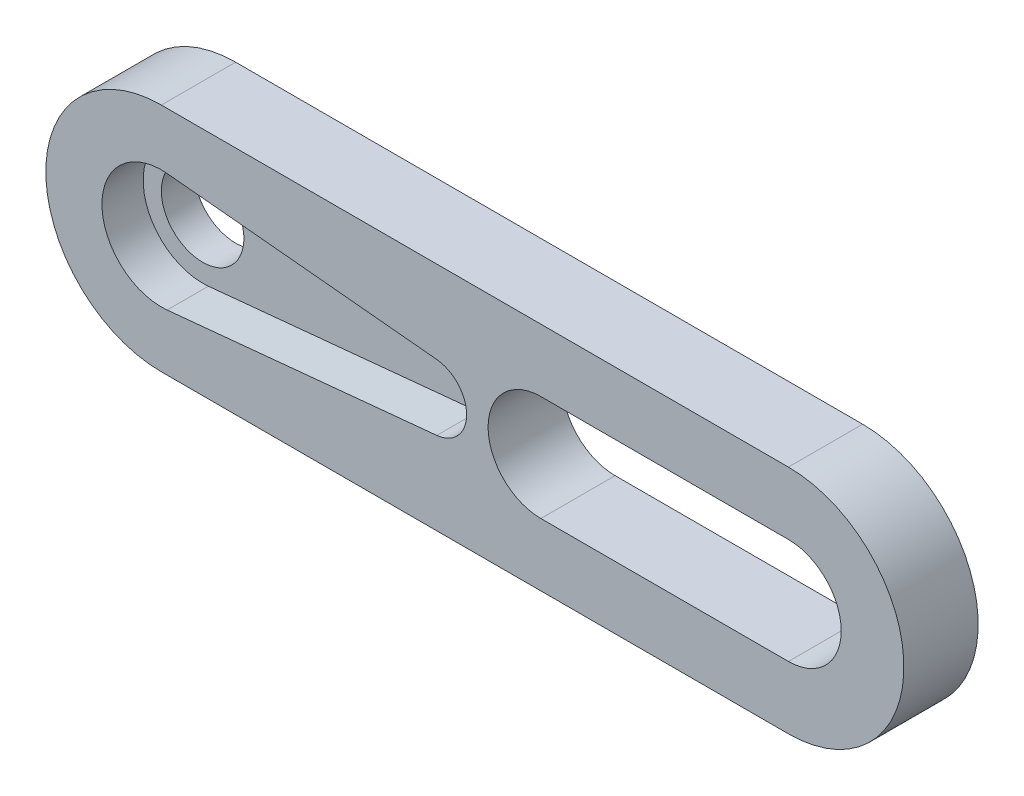
ISO-10303-21;
HEADER;
FILE_DESCRIPTION(('STEP AP214'),'2;1');
FILE_NAME('part.step','',(''),(''),'','','');
FILE_SCHEMA(('AUTOMOTIVE_DESIGN { 1 0 10303 214 1 1 1 1 }'));
ENDSEC;
DATA;
#1=APPLICATION_CONTEXT('core data for automotive mechanical design processes');
#2=APPLICATION_PROTOCOL_DEFINITION('international standard','automotive_design',2000,#1);
#3=PRODUCT_CONTEXT('',#1,'mechanical');
#4=PRODUCT('Part','Part','',(#3));
#5=PRODUCT_RELATED_PRODUCT_CATEGORY('part','',(#4));
#6=PRODUCT_DEFINITION_FORMATION('','',#4);
#7=PRODUCT_DEFINITION_CONTEXT('part definition',#1,'design');
#8=PRODUCT_DEFINITION('design','',#6,#7);
#9=PRODUCT_DEFINITION_SHAPE('','',#8);
#10=(LENGTH_UNIT() NAMED_UNIT(*) SI_UNIT(.MILLI.,.METRE.));
#11=(NAMED_UNIT(*) PLANE_ANGLE_UNIT() SI_UNIT($,.RADIAN.));
#12=(NAMED_UNIT(*) SI_UNIT($,.STERADIAN.) SOLID_ANGLE_UNIT());
#13=UNCERTAINTY_MEASURE_WITH_UNIT(LENGTH_MEASURE(1.E-05),#10,'distance_accuracy_value','');
#14=(GEOMETRIC_REPRESENTATION_CONTEXT(3) GLOBAL_UNCERTAINTY_ASSIGNED_CONTEXT((#13)) GLOBAL_UNIT_ASSIGNED_CONTEXT((#10,
#11,#12)) REPRESENTATION_CONTEXT('',''));
#15=CARTESIAN_POINT('',(0.,0.,0.));
#16=DIRECTION('',(0.,0.,1.));
#17=DIRECTION('',(1.,0.,0.));
#18=AXIS2_PLACEMENT_3D('',#15,#16,#17);
#19=CARTESIAN_POINT('',(0.,0.,2.5));
#20=DIRECTION('',(0.,0.,-1.));
#21=DIRECTION('',(-1.,0.,0.));
#22=AXIS2_PLACEMENT_3D('',#19,#20,#21);
#23=PLANE('',#22);
#24=CARTESIAN_POINT('',(0.,0.,2.5));
#25=DIRECTION('',(0.,0.,1.));
#26=DIRECTION('',(1.,0.,0.));
#27=AXIS2_PLACEMENT_3D('',#24,#25,#26);
#28=CIRCLE('',#27,3.6);
#29=CARTESIAN_POINT('',(0.349090909090909,3.58303440357333,2.5));
#30=VERTEX_POINT('',#29);
#31=CARTESIAN_POINT('',(0.349090909090909,-3.58303440357333,2.5));
#32=VERTEX_POINT('',#31);
#33=EDGE_CURVE('E175',#30,#32,#28,.T.);
#34=ORIENTED_EDGE('',*,*,#33,.F.);
#35=DIRECTION('',(-0.995287334325925,0.096969696969697,0.));
#36=VECTOR('',#35,1.);
#37=CARTESIAN_POINT('',(0.349090909090909,3.58303440357333,2.5));
#38=LINE('',#37,#36);
#39=CARTESIAN_POINT('',(16.6939393939394,1.99057466865185,2.5));
#40=VERTEX_POINT('',#39);
#41=EDGE_CURVE('E183',#40,#30,#38,.T.);
#42=ORIENTED_EDGE('',*,*,#41,.F.);
#43=CARTESIAN_POINT('',(16.5,0.,2.5));
#44=DIRECTION('',(0.,0.,1.));
#45=DIRECTION('',(1.,0.,0.));
#46=AXIS2_PLACEMENT_3D('',#43,#44,#45);
#47=CIRCLE('',#46,2.);
#48=CARTESIAN_POINT('',(16.6939393939394,-1.99057466865185,2.5));
#49=VERTEX_POINT('',#48);
#50=EDGE_CURVE('E180',#49,#40,#47,.T.);
#51=ORIENTED_EDGE('',*,*,#50,.F.);
#52=DIRECTION('',(0.995287334325925,0.0969696969696969,0.));
#53=VECTOR('',#52,1.);
#54=CARTESIAN_POINT('',(16.6939393939394,-1.99057466865185,2.5));
#55=LINE('',#54,#53);
#56=EDGE_CURVE('E177',#32,#49,#55,.T.);
#57=ORIENTED_EDGE('',*,*,#56,.F.);
#58=EDGE_LOOP('',(#34,#42,#51,#57));
#59=FACE_BOUND('',#58,.T.);
#60=CARTESIAN_POINT('',(0.,0.,2.5));
#61=DIRECTION('',(0.,0.,1.));
#62=DIRECTION('',(-1.,0.,0.));
#63=AXIS2_PLACEMENT_3D('',#60,#61,#62);
#64=CIRCLE('',#63,7.);
#65=CARTESIAN_POINT('',(0.,7.,2.5));
#66=VERTEX_POINT('',#65);
#67=CARTESIAN_POINT('',(0.,-7.,2.5));
#68=VERTEX_POINT('',#67);
#69=EDGE_CURVE('E204',#66,#68,#64,.T.);
#70=ORIENTED_EDGE('',*,*,#69,.T.);
#71=DIRECTION('',(1.,0.,0.));
#72=VECTOR('',#71,1.);
#73=CARTESIAN_POINT('',(0.,-7.,2.5));
#74=LINE('',#73,#72);
#75=CARTESIAN_POINT('',(38.,-7.,2.5));
#76=VERTEX_POINT('',#75);
#77=EDGE_CURVE('E207',#68,#76,#74,.T.);
#78=ORIENTED_EDGE('',*,*,#77,.T.);
#79=CARTESIAN_POINT('',(38.,0.,2.5));
#80=DIRECTION('',(0.,0.,1.));
#81=DIRECTION('',(-1.,0.,0.));
#82=AXIS2_PLACEMENT_3D('',#79,#80,#81);
#83=CIRCLE('',#82,7.);
#84=CARTESIAN_POINT('',(38.,7.,2.5));
#85=VERTEX_POINT('',#84);
#86=EDGE_CURVE('E209',#76,#85,#83,.T.);
#87=ORIENTED_EDGE('',*,*,#86,.T.);
#88=DIRECTION('',(-1.,0.,0.));
#89=VECTOR('',#88,1.);
#90=CARTESIAN_POINT('',(0.,7.,2.5));
#91=LINE('',#90,#89);
#92=EDGE_CURVE('E211',#85,#66,#91,.T.);
#93=ORIENTED_EDGE('',*,*,#92,.T.);
#94=EDGE_LOOP('',(#70,#78,#87,#93));
#95=FACE_BOUND('',#94,.T.);
#96=CARTESIAN_POINT('',(23.,0.,2.5));
#97=DIRECTION('',(0.,0.,1.));
#98=DIRECTION('',(1.,0.,0.));
#99=AXIS2_PLACEMENT_3D('',#96,#97,#98);
#100=CIRCLE('',#99,3.2);
#101=CARTESIAN_POINT('',(23.,3.2,2.5));
#102=VERTEX_POINT('',#101);
#103=CARTESIAN_POINT('',(23.,-3.2,2.5));
#104=VERTEX_POINT('',#103);
#105=EDGE_CURVE('E128',#102,#104,#100,.T.);
#106=ORIENTED_EDGE('',*,*,#105,.F.);
#107=DIRECTION('',(-1.,0.,0.));
#108=VECTOR('',#107,1.);
#109=CARTESIAN_POINT('',(23.,3.2,2.5));
#110=LINE('',#109,#108);
#111=CARTESIAN_POINT('',(38.,3.2,2.5));
#112=VERTEX_POINT('',#111);
#113=EDGE_CURVE('E169',#112,#102,#110,.T.);
#114=ORIENTED_EDGE('',*,*,#113,.F.);
#115=CARTESIAN_POINT('',(38.,0.,2.5));
#116=DIRECTION('',(0.,0.,1.));
#117=DIRECTION('',(1.,0.,0.));
#118=AXIS2_PLACEMENT_3D('',#115,#116,#117);
#119=CIRCLE('',#118,3.2);
#120=CARTESIAN_POINT('',(38.,-3.2,2.5));
#121=VERTEX_POINT('',#120);
#122=EDGE_CURVE('E167',#121,#112,#119,.T.);
#123=ORIENTED_EDGE('',*,*,#122,.F.);
#124=DIRECTION('',(1.,0.,0.));
#125=VECTOR('',#124,1.);
#126=CARTESIAN_POINT('',(23.,-3.2,2.5));
#127=LINE('',#126,#125);
#128=EDGE_CURVE('E165',#104,#121,#127,.T.);
#129=ORIENTED_EDGE('',*,*,#128,.F.);
#130=EDGE_LOOP('',(#106,#114,#123,#129));
#131=FACE_BOUND('',#130,.T.);
#132=ADVANCED_FACE('F32',(#59,#95,#131),#23,.F.);
#133=CARTESIAN_POINT('',(0.,0.,2.5));
#134=DIRECTION('',(0.,0.,-1.));
#135=DIRECTION('',(-1.,0.,0.));
#136=AXIS2_PLACEMENT_3D('',#133,#134,#135);
#137=CYLINDRICAL_SURFACE('',#136,7.);
#138=DIRECTION('',(0.,0.,-1.));
#139=VECTOR('',#138,1.);
#140=CARTESIAN_POINT('',(0.,7.,2.5));
#141=LINE('',#140,#139);
#142=CARTESIAN_POINT('',(0.,7.,-2.));
#143=VERTEX_POINT('',#142);
#144=EDGE_CURVE('E213',#66,#143,#141,.T.);
#145=ORIENTED_EDGE('',*,*,#144,.T.);
#146=CARTESIAN_POINT('',(0.,0.,-2.));
#147=DIRECTION('',(0.,0.,-1.));
#148=DIRECTION('',(-1.,0.,0.));
#149=AXIS2_PLACEMENT_3D('',#146,#147,#148);
#150=CIRCLE('',#149,7.);
#151=CARTESIAN_POINT('',(0.,-7.,-2.));
#152=VERTEX_POINT('',#151);
#153=EDGE_CURVE('E150',#152,#143,#150,.T.);
#154=ORIENTED_EDGE('',*,*,#153,.F.);
#155=DIRECTION('',(0.,0.,-1.));
#156=VECTOR('',#155,1.);
#157=CARTESIAN_POINT('',(0.,-7.,2.5));
#158=LINE('',#157,#156);
#159=EDGE_CURVE('E11',#68,#152,#158,.T.);
#160=ORIENTED_EDGE('',*,*,#159,.F.);
#161=ORIENTED_EDGE('',*,*,#69,.F.);
#162=EDGE_LOOP('',(#145,#154,#160,#161));
#163=FACE_BOUND('',#162,.T.);
#164=ADVANCED_FACE('F34',(#163),#137,.T.);
#165=CARTESIAN_POINT('',(0.,-7.,2.5));
#166=DIRECTION('',(0.,1.,0.));
#167=DIRECTION('',(-1.,0.,0.));
#168=AXIS2_PLACEMENT_3D('',#165,#166,#167);
#169=PLANE('',#168);
#170=ORIENTED_EDGE('',*,*,#159,.T.);
#171=DIRECTION('',(-1.,0.,0.));
#172=VECTOR('',#171,1.);
#173=CARTESIAN_POINT('',(0.,-7.,-2.));
#174=LINE('',#173,#172);
#175=CARTESIAN_POINT('',(38.,-7.,-2.));
#176=VERTEX_POINT('',#175);
#177=EDGE_CURVE('E161',#176,#152,#174,.T.);
#178=ORIENTED_EDGE('',*,*,#177,.F.);
#179=DIRECTION('',(0.,0.,-1.));
#180=VECTOR('',#179,1.);
#181=CARTESIAN_POINT('',(38.,-7.,2.5));
#182=LINE('',#181,#180);
#183=EDGE_CURVE('E40',#76,#176,#182,.T.);
#184=ORIENTED_EDGE('',*,*,#183,.F.);
#185=ORIENTED_EDGE('',*,*,#77,.F.);
#186=EDGE_LOOP('',(#170,#178,#184,#185));
#187=FACE_BOUND('',#186,.T.);
#188=ADVANCED_FACE('F227',(#187),#169,.F.);
#189=CARTESIAN_POINT('',(38.,0.,2.5));
#190=DIRECTION('',(0.,0.,-1.));
#191=DIRECTION('',(-1.,0.,0.));
#192=AXIS2_PLACEMENT_3D('',#189,#190,#191);
#193=CYLINDRICAL_SURFACE('',#192,7.);
#194=ORIENTED_EDGE('',*,*,#183,.T.);
#195=CARTESIAN_POINT('',(38.,0.,-2.));
#196=DIRECTION('',(0.,0.,-1.));
#197=DIRECTION('',(-1.,0.,0.));
#198=AXIS2_PLACEMENT_3D('',#195,#196,#197);
#199=CIRCLE('',#198,7.);
#200=CARTESIAN_POINT('',(38.,7.,-2.));
#201=VERTEX_POINT('',#200);
#202=EDGE_CURVE('E158',#201,#176,#199,.T.);
#203=ORIENTED_EDGE('',*,*,#202,.F.);
#204=DIRECTION('',(0.,0.,-1.));
#205=VECTOR('',#204,1.);
#206=CARTESIAN_POINT('',(38.,7.,2.5));
#207=LINE('',#206,#205);
#208=EDGE_CURVE('E215',#85,#201,#207,.T.);
#209=ORIENTED_EDGE('',*,*,#208,.F.);
#210=ORIENTED_EDGE('',*,*,#86,.F.);
#211=EDGE_LOOP('',(#194,#203,#209,#210));
#212=FACE_BOUND('',#211,.T.);
#213=ADVANCED_FACE('F220',(#212),#193,.T.);
#214=CARTESIAN_POINT('',(0.,7.,2.5));
#215=DIRECTION('',(0.,-1.,0.));
#216=DIRECTION('',(1.,0.,0.));
#217=AXIS2_PLACEMENT_3D('',#214,#215,#216);
#218=PLANE('',#217);
#219=ORIENTED_EDGE('',*,*,#208,.T.);
#220=DIRECTION('',(1.,0.,0.));
#221=VECTOR('',#220,1.);
#222=CARTESIAN_POINT('',(0.,7.,-2.));
#223=LINE('',#222,#221);
#224=EDGE_CURVE('E155',#143,#201,#223,.T.);
#225=ORIENTED_EDGE('',*,*,#224,.F.);
#226=ORIENTED_EDGE('',*,*,#144,.F.);
#227=ORIENTED_EDGE('',*,*,#92,.F.);
#228=EDGE_LOOP('',(#219,#225,#226,#227));
#229=FACE_BOUND('',#228,.T.);
#230=ADVANCED_FACE('F234',(#229),#218,.F.);
#231=CARTESIAN_POINT('',(0.,0.,2.5));
#232=DIRECTION('',(0.,0.,-1.));
#233=DIRECTION('',(-1.,0.,0.));
#234=AXIS2_PLACEMENT_3D('',#231,#232,#233);
#235=CYLINDRICAL_SURFACE('',#234,3.6);
#236=CARTESIAN_POINT('',(0.,0.,0.));
#237=DIRECTION('',(0.,0.,1.));
#238=DIRECTION('',(1.,0.,0.));
#239=AXIS2_PLACEMENT_3D('',#236,#237,#238);
#240=CIRCLE('',#239,3.6);
#241=CARTESIAN_POINT('',(0.349090909090909,3.58303440357333,0.));
#242=VERTEX_POINT('',#241);
#243=CARTESIAN_POINT('',(0.349090909090909,-3.58303440357333,0.));
#244=VERTEX_POINT('',#243);
#245=EDGE_CURVE('E130',#242,#244,#240,.T.);
#246=ORIENTED_EDGE('',*,*,#245,.F.);
#247=DIRECTION('',(0.,0.,-1.));
#248=VECTOR('',#247,1.);
#249=CARTESIAN_POINT('',(0.349090909090909,3.58303440357333,2.5));
#250=LINE('',#249,#248);
#251=EDGE_CURVE('E185',#30,#242,#250,.T.);
#252=ORIENTED_EDGE('',*,*,#251,.F.);
#253=ORIENTED_EDGE('',*,*,#33,.T.);
#254=DIRECTION('',(0.,0.,-1.));
#255=VECTOR('',#254,1.);
#256=CARTESIAN_POINT('',(0.349090909090909,-3.58303440357333,2.5));
#257=LINE('',#256,#255);
#258=EDGE_CURVE('E201',#32,#244,#257,.T.);
#259=ORIENTED_EDGE('',*,*,#258,.T.);
#260=EDGE_LOOP('',(#246,#252,#253,#259));
#261=FACE_BOUND('',#260,.T.);
#262=ADVANCED_FACE('F272',(#261),#235,.F.);
#263=CARTESIAN_POINT('',(16.6939393939394,-1.99057466865185,2.5));
#264=DIRECTION('',(-0.0969696969696969,0.995287334325925,0.));
#265=DIRECTION('',(-0.995287334325925,-0.0969696969696969,0.));
#266=AXIS2_PLACEMENT_3D('',#263,#264,#265);
#267=PLANE('',#266);
#268=DIRECTION('',(0.995287334325925,0.0969696969696969,0.));
#269=VECTOR('',#268,1.);
#270=CARTESIAN_POINT('',(16.6939393939394,-1.99057466865185,0.));
#271=LINE('',#270,#269);
#272=CARTESIAN_POINT('',(16.6939393939394,-1.99057466865185,0.));
#273=VERTEX_POINT('',#272);
#274=EDGE_CURVE('E188',#244,#273,#271,.T.);
#275=ORIENTED_EDGE('',*,*,#274,.F.);
#276=ORIENTED_EDGE('',*,*,#258,.F.);
#277=ORIENTED_EDGE('',*,*,#56,.T.);
#278=DIRECTION('',(0.,0.,-1.));
#279=VECTOR('',#278,1.);
#280=CARTESIAN_POINT('',(16.6939393939394,-1.99057466865185,2.5));
#281=LINE('',#280,#279);
#282=EDGE_CURVE('E199',#49,#273,#281,.T.);
#283=ORIENTED_EDGE('',*,*,#282,.T.);
#284=EDGE_LOOP('',(#275,#276,#277,#283));
#285=FACE_BOUND('',#284,.T.);
#286=ADVANCED_FACE('F268',(#285),#267,.T.);
#287=CARTESIAN_POINT('',(16.5,0.,2.5));
#288=DIRECTION('',(0.,0.,-1.));
#289=DIRECTION('',(-1.,0.,0.));
#290=AXIS2_PLACEMENT_3D('',#287,#288,#289);
#291=CYLINDRICAL_SURFACE('',#290,2.);
#292=CARTESIAN_POINT('',(16.5,0.,0.));
#293=DIRECTION('',(0.,0.,1.));
#294=DIRECTION('',(1.,0.,0.));
#295=AXIS2_PLACEMENT_3D('',#292,#293,#294);
#296=CIRCLE('',#295,2.);
#297=CARTESIAN_POINT('',(16.6939393939394,1.99057466865185,0.));
#298=VERTEX_POINT('',#297);
#299=EDGE_CURVE('E191',#273,#298,#296,.T.);
#300=ORIENTED_EDGE('',*,*,#299,.F.);
#301=ORIENTED_EDGE('',*,*,#282,.F.);
#302=ORIENTED_EDGE('',*,*,#50,.T.);
#303=DIRECTION('',(0.,0.,-1.));
#304=VECTOR('',#303,1.);
#305=CARTESIAN_POINT('',(16.6939393939394,1.99057466865185,2.5));
#306=LINE('',#305,#304);
#307=EDGE_CURVE('E197',#40,#298,#306,.T.);
#308=ORIENTED_EDGE('',*,*,#307,.T.);
#309=EDGE_LOOP('',(#300,#301,#302,#308));
#310=FACE_BOUND('',#309,.T.);
#311=ADVANCED_FACE('F264',(#310),#291,.F.);
#312=CARTESIAN_POINT('',(0.349090909090909,3.58303440357333,2.5));
#313=DIRECTION('',(-0.096969696969697,-0.995287334325925,0.));
#314=DIRECTION('',(0.995287334325925,-0.096969696969697,0.));
#315=AXIS2_PLACEMENT_3D('',#312,#313,#314);
#316=PLANE('',#315);
#317=DIRECTION('',(-0.995287334325925,0.096969696969697,0.));
#318=VECTOR('',#317,1.);
#319=CARTESIAN_POINT('',(0.349090909090909,3.58303440357333,0.));
#320=LINE('',#319,#318);
#321=EDGE_CURVE('E178',#298,#242,#320,.T.);
#322=ORIENTED_EDGE('',*,*,#321,.F.);
#323=ORIENTED_EDGE('',*,*,#307,.F.);
#324=ORIENTED_EDGE('',*,*,#41,.T.);
#325=ORIENTED_EDGE('',*,*,#251,.T.);
#326=EDGE_LOOP('',(#322,#323,#324,#325));
#327=FACE_BOUND('',#326,.T.);
#328=ADVANCED_FACE('F261',(#327),#316,.T.);
#329=CARTESIAN_POINT('',(23.,0.,2.5));
#330=DIRECTION('',(0.,0.,-1.));
#331=DIRECTION('',(-1.,0.,0.));
#332=AXIS2_PLACEMENT_3D('',#329,#330,#331);
#333=CYLINDRICAL_SURFACE('',#332,3.2);
#334=DIRECTION('',(0.,0.,-1.));
#335=VECTOR('',#334,1.);
#336=CARTESIAN_POINT('',(23.,-3.2,2.5));
#337=LINE('',#336,#335);
#338=CARTESIAN_POINT('',(23.,-3.2,-2.));
#339=VERTEX_POINT('',#338);
#340=EDGE_CURVE('E121',#104,#339,#337,.T.);
#341=ORIENTED_EDGE('',*,*,#340,.T.);
#342=CARTESIAN_POINT('',(23.,0.,-2.));
#343=DIRECTION('',(0.,0.,1.));
#344=DIRECTION('',(1.,0.,0.));
#345=AXIS2_PLACEMENT_3D('',#342,#343,#344);
#346=CIRCLE('',#345,3.2);
#347=CARTESIAN_POINT('',(23.,3.2,-2.));
#348=VERTEX_POINT('',#347);
#349=EDGE_CURVE('E125',#348,#339,#346,.T.);
#350=ORIENTED_EDGE('',*,*,#349,.F.);
#351=DIRECTION('',(0.,0.,-1.));
#352=VECTOR('',#351,1.);
#353=CARTESIAN_POINT('',(23.,3.2,2.5));
#354=LINE('',#353,#352);
#355=EDGE_CURVE('E171',#102,#348,#354,.T.);
#356=ORIENTED_EDGE('',*,*,#355,.F.);
#357=ORIENTED_EDGE('',*,*,#105,.T.);
#358=EDGE_LOOP('',(#341,#350,#356,#357));
#359=FACE_BOUND('',#358,.T.);
#360=ADVANCED_FACE('F122',(#359),#333,.F.);
#361=CARTESIAN_POINT('',(23.,-3.2,2.5));
#362=DIRECTION('',(0.,1.,0.));
#363=DIRECTION('',(0.,0.,1.));
#364=AXIS2_PLACEMENT_3D('',#361,#362,#363);
#365=PLANE('',#364);
#366=DIRECTION('',(0.,0.,-1.));
#367=VECTOR('',#366,1.);
#368=CARTESIAN_POINT('',(38.,-3.2,2.5));
#369=LINE('',#368,#367);
#370=CARTESIAN_POINT('',(38.,-3.2,-2.));
#371=VERTEX_POINT('',#370);
#372=EDGE_CURVE('E47',#121,#371,#369,.T.);
#373=ORIENTED_EDGE('',*,*,#372,.T.);
#374=DIRECTION('',(1.,0.,0.));
#375=VECTOR('',#374,1.);
#376=CARTESIAN_POINT('',(23.,-3.2,-2.));
#377=LINE('',#376,#375);
#378=EDGE_CURVE('E133',#339,#371,#377,.T.);
#379=ORIENTED_EDGE('',*,*,#378,.F.);
#380=ORIENTED_EDGE('',*,*,#340,.F.);
#381=ORIENTED_EDGE('',*,*,#128,.T.);
#382=EDGE_LOOP('',(#373,#379,#380,#381));
#383=FACE_BOUND('',#382,.T.);
#384=ADVANCED_FACE('F134',(#383),#365,.T.);
#385=CARTESIAN_POINT('',(38.,0.,2.5));
#386=DIRECTION('',(0.,0.,-1.));
#387=DIRECTION('',(-1.,0.,0.));
#388=AXIS2_PLACEMENT_3D('',#385,#386,#387);
#389=CYLINDRICAL_SURFACE('',#388,3.2);
#390=DIRECTION('',(0.,0.,-1.));
#391=VECTOR('',#390,1.);
#392=CARTESIAN_POINT('',(38.,3.2,2.5));
#393=LINE('',#392,#391);
#394=CARTESIAN_POINT('',(38.,3.2,-2.));
#395=VERTEX_POINT('',#394);
#396=EDGE_CURVE('E55',#112,#395,#393,.T.);
#397=ORIENTED_EDGE('',*,*,#396,.T.);
#398=CARTESIAN_POINT('',(38.,0.,-2.));
#399=DIRECTION('',(0.,0.,1.));
#400=DIRECTION('',(1.,0.,0.));
#401=AXIS2_PLACEMENT_3D('',#398,#399,#400);
#402=CIRCLE('',#401,3.2);
#403=EDGE_CURVE('E137',#371,#395,#402,.T.);
#404=ORIENTED_EDGE('',*,*,#403,.F.);
#405=ORIENTED_EDGE('',*,*,#372,.F.);
#406=ORIENTED_EDGE('',*,*,#122,.T.);
#407=EDGE_LOOP('',(#397,#404,#405,#406));
#408=FACE_BOUND('',#407,.T.);
#409=ADVANCED_FACE('F243',(#408),#389,.F.);
#410=CARTESIAN_POINT('',(23.,3.2,2.5));
#411=DIRECTION('',(0.,-1.,0.));
#412=DIRECTION('',(0.,0.,-1.));
#413=AXIS2_PLACEMENT_3D('',#410,#411,#412);
#414=PLANE('',#413);
#415=ORIENTED_EDGE('',*,*,#355,.T.);
#416=DIRECTION('',(-1.,0.,0.));
#417=VECTOR('',#416,1.);
#418=CARTESIAN_POINT('',(23.,3.2,-2.));
#419=LINE('',#418,#417);
#420=EDGE_CURVE('E141',#395,#348,#419,.T.);
#421=ORIENTED_EDGE('',*,*,#420,.F.);
#422=ORIENTED_EDGE('',*,*,#396,.F.);
#423=ORIENTED_EDGE('',*,*,#113,.T.);
#424=EDGE_LOOP('',(#415,#421,#422,#423));
#425=FACE_BOUND('',#424,.T.);
#426=ADVANCED_FACE('F244',(#425),#414,.T.);
#427=CARTESIAN_POINT('',(0.,0.,0.));
#428=DIRECTION('',(0.,0.,-1.));
#429=DIRECTION('',(-1.,0.,0.));
#430=AXIS2_PLACEMENT_3D('',#427,#428,#429);
#431=PLANE('',#430);
#432=ORIENTED_EDGE('',*,*,#245,.T.);
#433=ORIENTED_EDGE('',*,*,#274,.T.);
#434=ORIENTED_EDGE('',*,*,#299,.T.);
#435=ORIENTED_EDGE('',*,*,#321,.T.);
#436=EDGE_LOOP('',(#432,#433,#434,#435));
#437=FACE_BOUND('',#436,.T.);
#438=CARTESIAN_POINT('',(0.,0.,0.));
#439=DIRECTION('',(0.,0.,-1.));
#440=DIRECTION('',(-1.,0.,0.));
#441=AXIS2_PLACEMENT_3D('',#438,#439,#440);
#442=CIRCLE('',#441,2.5);
#443=CARTESIAN_POINT('',(-2.5,0.,0.));
#444=VERTEX_POINT('',#443);
#445=EDGE_CURVE('E146',#444,#444,#442,.T.);
#446=ORIENTED_EDGE('',*,*,#445,.T.);
#447=EDGE_LOOP('',(#446));
#448=FACE_BOUND('',#447,.T.);
#449=ADVANCED_FACE('F246',(#437,#448),#431,.F.);
#450=CARTESIAN_POINT('',(0.,0.,-2.));
#451=DIRECTION('',(0.,0.,-1.));
#452=DIRECTION('',(-1.,0.,0.));
#453=AXIS2_PLACEMENT_3D('',#450,#451,#452);
#454=PLANE('',#453);
#455=ORIENTED_EDGE('',*,*,#349,.T.);
#456=ORIENTED_EDGE('',*,*,#378,.T.);
#457=ORIENTED_EDGE('',*,*,#403,.T.);
#458=ORIENTED_EDGE('',*,*,#420,.T.);
#459=EDGE_LOOP('',(#455,#456,#457,#458));
#460=FACE_BOUND('',#459,.T.);
#461=ORIENTED_EDGE('',*,*,#153,.T.);
#462=ORIENTED_EDGE('',*,*,#224,.T.);
#463=ORIENTED_EDGE('',*,*,#202,.T.);
#464=ORIENTED_EDGE('',*,*,#177,.T.);
#465=EDGE_LOOP('',(#461,#462,#463,#464));
#466=FACE_BOUND('',#465,.T.);
#467=CARTESIAN_POINT('',(0.,0.,-2.));
#468=DIRECTION('',(0.,0.,-1.));
#469=DIRECTION('',(-1.,0.,0.));
#470=AXIS2_PLACEMENT_3D('',#467,#468,#469);
#471=CIRCLE('',#470,2.5);
#472=CARTESIAN_POINT('',(-2.5,0.,-2.));
#473=VERTEX_POINT('',#472);
#474=EDGE_CURVE('E147',#473,#473,#471,.T.);
#475=ORIENTED_EDGE('',*,*,#474,.F.);
#476=EDGE_LOOP('',(#475));
#477=FACE_BOUND('',#476,.T.);
#478=ADVANCED_FACE('F139',(#460,#466,#477),#454,.T.);
#479=CARTESIAN_POINT('',(0.,0.,-2.));
#480=DIRECTION('',(0.,0.,1.));
#481=DIRECTION('',(1.,0.,0.));
#482=AXIS2_PLACEMENT_3D('',#479,#480,#481);
#483=CYLINDRICAL_SURFACE('',#482,2.5);
#484=ORIENTED_EDGE('',*,*,#474,.T.);
#485=EDGE_LOOP('',(#484));
#486=FACE_BOUND('',#485,.T.);
#487=ORIENTED_EDGE('',*,*,#445,.F.);
#488=EDGE_LOOP('',(#487));
#489=FACE_BOUND('',#488,.T.);
#490=ADVANCED_FACE('F378',(#486,#489),#483,.F.);
#491=CLOSED_SHELL('',(#132,#164,#188,#213,#230,#262,#286,#311,#328,#360,#384,#409,#426,#449,
#478,#490));
#492=MANIFOLD_SOLID_BREP('B2',#491);
#493=ADVANCED_BREP_SHAPE_REPRESENTATION('',(#18,#492),#14);
#494=SHAPE_DEFINITION_REPRESENTATION(#9,#493);
ENDSEC;
END-ISO-10303-21;
